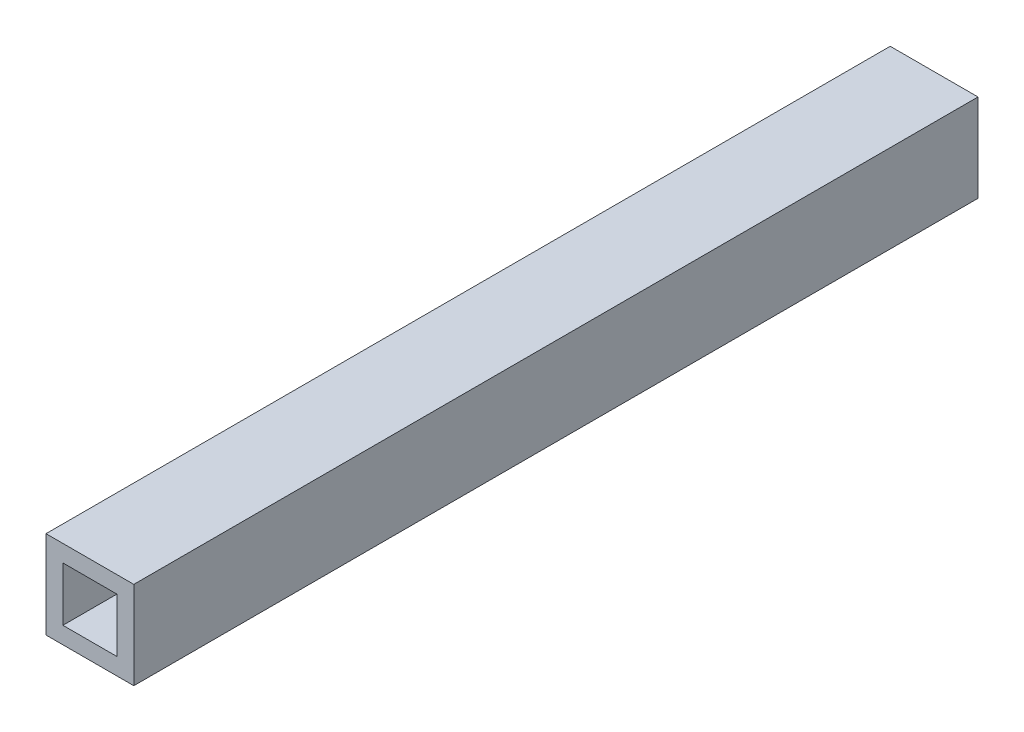
ISO-10303-21;
HEADER;
FILE_DESCRIPTION(('STEP AP214'),'2;1');
FILE_NAME('part.step','',(''),(''),'','','');
FILE_SCHEMA(('AUTOMOTIVE_DESIGN { 1 0 10303 214 1 1 1 1 }'));
ENDSEC;
DATA;
#1=APPLICATION_CONTEXT('core data for automotive mechanical design processes');
#2=APPLICATION_PROTOCOL_DEFINITION('international standard','automotive_design',2000,#1);
#3=PRODUCT_CONTEXT('',#1,'mechanical');
#4=PRODUCT('Part','Part','',(#3));
#5=PRODUCT_RELATED_PRODUCT_CATEGORY('part','',(#4));
#6=PRODUCT_DEFINITION_FORMATION('','',#4);
#7=PRODUCT_DEFINITION_CONTEXT('part definition',#1,'design');
#8=PRODUCT_DEFINITION('design','',#6,#7);
#9=PRODUCT_DEFINITION_SHAPE('','',#8);
#10=(LENGTH_UNIT() NAMED_UNIT(*) SI_UNIT(.MILLI.,.METRE.));
#11=(NAMED_UNIT(*) PLANE_ANGLE_UNIT() SI_UNIT($,.RADIAN.));
#12=(NAMED_UNIT(*) SI_UNIT($,.STERADIAN.) SOLID_ANGLE_UNIT());
#13=UNCERTAINTY_MEASURE_WITH_UNIT(LENGTH_MEASURE(1.E-05),#10,'distance_accuracy_value','');
#14=(GEOMETRIC_REPRESENTATION_CONTEXT(3) GLOBAL_UNCERTAINTY_ASSIGNED_CONTEXT((#13)) GLOBAL_UNIT_ASSIGNED_CONTEXT((#10,
#11,#12)) REPRESENTATION_CONTEXT('',''));
#15=CARTESIAN_POINT('',(0.,0.,0.));
#16=DIRECTION('',(0.,0.,1.));
#17=DIRECTION('',(1.,0.,0.));
#18=AXIS2_PLACEMENT_3D('',#15,#16,#17);
#19=CARTESIAN_POINT('',(0.,0.,10.));
#20=DIRECTION('',(0.,0.,-1.));
#21=DIRECTION('',(-1.,0.,0.));
#22=AXIS2_PLACEMENT_3D('',#19,#20,#21);
#23=PLANE('',#22);
#24=DIRECTION('',(-1.,0.,0.));
#25=VECTOR('',#24,1.);
#26=CARTESIAN_POINT('',(-19.3872922312086,-16.1708129393611,10.));
#27=LINE('',#26,#25);
#28=CARTESIAN_POINT('',(-18.3472922312086,-16.1708129393611,10.));
#29=VERTEX_POINT('',#28);
#30=CARTESIAN_POINT('',(-19.3872922312086,-16.1708129393611,10.));
#31=VERTEX_POINT('',#30);
#32=EDGE_CURVE('E153',#29,#31,#27,.T.);
#33=ORIENTED_EDGE('',*,*,#32,.T.);
#34=DIRECTION('',(0.,-1.,0.));
#35=VECTOR('',#34,1.);
#36=CARTESIAN_POINT('',(-19.3872922312086,-16.1708129393611,10.));
#37=LINE('',#36,#35);
#38=CARTESIAN_POINT('',(-19.3872922312086,-17.2108129393611,10.));
#39=VERTEX_POINT('',#38);
#40=EDGE_CURVE('E157',#31,#39,#37,.T.);
#41=ORIENTED_EDGE('',*,*,#40,.T.);
#42=DIRECTION('',(1.,0.,0.));
#43=VECTOR('',#42,1.);
#44=CARTESIAN_POINT('',(-19.3872922312086,-17.2108129393611,10.));
#45=LINE('',#44,#43);
#46=CARTESIAN_POINT('',(-18.3472922312086,-17.2108129393611,10.));
#47=VERTEX_POINT('',#46);
#48=EDGE_CURVE('E161',#39,#47,#45,.T.);
#49=ORIENTED_EDGE('',*,*,#48,.T.);
#50=DIRECTION('',(0.,1.,0.));
#51=VECTOR('',#50,1.);
#52=CARTESIAN_POINT('',(-18.3472922312086,-16.1708129393611,10.));
#53=LINE('',#52,#51);
#54=EDGE_CURVE('E164',#47,#29,#53,.T.);
#55=ORIENTED_EDGE('',*,*,#54,.T.);
#56=EDGE_LOOP('',(#33,#41,#49,#55));
#57=FACE_BOUND('',#56,.T.);
#58=DIRECTION('',(0.,1.,0.));
#59=VECTOR('',#58,1.);
#60=CARTESIAN_POINT('',(-18.5472922312086,-16.3708129393611,10.));
#61=LINE('',#60,#59);
#62=CARTESIAN_POINT('',(-18.5472922312086,-17.0108129393611,10.));
#63=VERTEX_POINT('',#62);
#64=CARTESIAN_POINT('',(-18.5472922312086,-16.3708129393611,10.));
#65=VERTEX_POINT('',#64);
#66=EDGE_CURVE('E105',#63,#65,#61,.T.);
#67=ORIENTED_EDGE('',*,*,#66,.F.);
#68=DIRECTION('',(1.,0.,0.));
#69=VECTOR('',#68,1.);
#70=CARTESIAN_POINT('',(-19.1872922312086,-17.0108129393611,10.));
#71=LINE('',#70,#69);
#72=CARTESIAN_POINT('',(-19.1872922312086,-17.0108129393611,10.));
#73=VERTEX_POINT('',#72);
#74=EDGE_CURVE('E131',#73,#63,#71,.T.);
#75=ORIENTED_EDGE('',*,*,#74,.F.);
#76=DIRECTION('',(0.,-1.,0.));
#77=VECTOR('',#76,1.);
#78=CARTESIAN_POINT('',(-19.1872922312086,-16.3708129393611,10.));
#79=LINE('',#78,#77);
#80=CARTESIAN_POINT('',(-19.1872922312086,-16.3708129393611,10.));
#81=VERTEX_POINT('',#80);
#82=EDGE_CURVE('E127',#81,#73,#79,.T.);
#83=ORIENTED_EDGE('',*,*,#82,.F.);
#84=DIRECTION('',(-1.,0.,0.));
#85=VECTOR('',#84,1.);
#86=CARTESIAN_POINT('',(-19.1872922312086,-16.3708129393611,10.));
#87=LINE('',#86,#85);
#88=EDGE_CURVE('E114',#65,#81,#87,.T.);
#89=ORIENTED_EDGE('',*,*,#88,.F.);
#90=EDGE_LOOP('',(#67,#75,#83,#89));
#91=FACE_BOUND('',#90,.T.);
#92=ADVANCED_FACE('F39',(#57,#91),#23,.F.);
#93=CARTESIAN_POINT('',(0.,0.,0.));
#94=DIRECTION('',(0.,0.,-1.));
#95=DIRECTION('',(-1.,0.,0.));
#96=AXIS2_PLACEMENT_3D('',#93,#94,#95);
#97=PLANE('',#96);
#98=DIRECTION('',(-1.,0.,0.));
#99=VECTOR('',#98,1.);
#100=CARTESIAN_POINT('',(-19.3872922312086,-16.1708129393611,0.));
#101=LINE('',#100,#99);
#102=CARTESIAN_POINT('',(-18.3472922312086,-16.1708129393611,0.));
#103=VERTEX_POINT('',#102);
#104=CARTESIAN_POINT('',(-19.3872922312086,-16.1708129393611,0.));
#105=VERTEX_POINT('',#104);
#106=EDGE_CURVE('E123',#103,#105,#101,.T.);
#107=ORIENTED_EDGE('',*,*,#106,.F.);
#108=DIRECTION('',(0.,1.,0.));
#109=VECTOR('',#108,1.);
#110=CARTESIAN_POINT('',(-18.3472922312086,-16.1708129393611,0.));
#111=LINE('',#110,#109);
#112=CARTESIAN_POINT('',(-18.3472922312086,-17.2108129393611,0.));
#113=VERTEX_POINT('',#112);
#114=EDGE_CURVE('E158',#113,#103,#111,.T.);
#115=ORIENTED_EDGE('',*,*,#114,.F.);
#116=DIRECTION('',(1.,0.,0.));
#117=VECTOR('',#116,1.);
#118=CARTESIAN_POINT('',(-19.3872922312086,-17.2108129393611,0.));
#119=LINE('',#118,#117);
#120=CARTESIAN_POINT('',(-19.3872922312086,-17.2108129393611,0.));
#121=VERTEX_POINT('',#120);
#122=EDGE_CURVE('E174',#121,#113,#119,.T.);
#123=ORIENTED_EDGE('',*,*,#122,.F.);
#124=DIRECTION('',(0.,-1.,0.));
#125=VECTOR('',#124,1.);
#126=CARTESIAN_POINT('',(-19.3872922312086,-16.1708129393611,0.));
#127=LINE('',#126,#125);
#128=EDGE_CURVE('E171',#105,#121,#127,.T.);
#129=ORIENTED_EDGE('',*,*,#128,.F.);
#130=EDGE_LOOP('',(#107,#115,#123,#129));
#131=FACE_BOUND('',#130,.T.);
#132=DIRECTION('',(1.,0.,0.));
#133=VECTOR('',#132,1.);
#134=CARTESIAN_POINT('',(-19.1872922312086,-17.0108129393611,0.));
#135=LINE('',#134,#133);
#136=CARTESIAN_POINT('',(-19.1872922312086,-17.0108129393611,0.));
#137=VERTEX_POINT('',#136);
#138=CARTESIAN_POINT('',(-18.5472922312086,-17.0108129393611,0.));
#139=VERTEX_POINT('',#138);
#140=EDGE_CURVE('E115',#137,#139,#135,.T.);
#141=ORIENTED_EDGE('',*,*,#140,.T.);
#142=DIRECTION('',(0.,1.,0.));
#143=VECTOR('',#142,1.);
#144=CARTESIAN_POINT('',(-18.5472922312086,-16.3708129393611,0.));
#145=LINE('',#144,#143);
#146=CARTESIAN_POINT('',(-18.5472922312086,-16.3708129393611,0.));
#147=VERTEX_POINT('',#146);
#148=EDGE_CURVE('E63',#139,#147,#145,.T.);
#149=ORIENTED_EDGE('',*,*,#148,.T.);
#150=DIRECTION('',(-1.,0.,0.));
#151=VECTOR('',#150,1.);
#152=CARTESIAN_POINT('',(-19.1872922312086,-16.3708129393611,0.));
#153=LINE('',#152,#151);
#154=CARTESIAN_POINT('',(-19.1872922312086,-16.3708129393611,0.));
#155=VERTEX_POINT('',#154);
#156=EDGE_CURVE('E121',#147,#155,#153,.T.);
#157=ORIENTED_EDGE('',*,*,#156,.T.);
#158=DIRECTION('',(0.,-1.,0.));
#159=VECTOR('',#158,1.);
#160=CARTESIAN_POINT('',(-19.1872922312086,-16.3708129393611,0.));
#161=LINE('',#160,#159);
#162=EDGE_CURVE('E140',#155,#137,#161,.T.);
#163=ORIENTED_EDGE('',*,*,#162,.T.);
#164=EDGE_LOOP('',(#141,#149,#157,#163));
#165=FACE_BOUND('',#164,.T.);
#166=ADVANCED_FACE('F197',(#131,#165),#97,.T.);
#167=CARTESIAN_POINT('',(-19.3872922312086,-16.1708129393611,10.));
#168=DIRECTION('',(0.,-1.,0.));
#169=DIRECTION('',(0.,0.,-1.));
#170=AXIS2_PLACEMENT_3D('',#167,#168,#169);
#171=PLANE('',#170);
#172=ORIENTED_EDGE('',*,*,#106,.T.);
#173=DIRECTION('',(0.,0.,-1.));
#174=VECTOR('',#173,1.);
#175=CARTESIAN_POINT('',(-19.3872922312086,-16.1708129393611,10.));
#176=LINE('',#175,#174);
#177=EDGE_CURVE('E11',#31,#105,#176,.T.);
#178=ORIENTED_EDGE('',*,*,#177,.F.);
#179=ORIENTED_EDGE('',*,*,#32,.F.);
#180=DIRECTION('',(0.,0.,-1.));
#181=VECTOR('',#180,1.);
#182=CARTESIAN_POINT('',(-18.3472922312086,-16.1708129393611,10.));
#183=LINE('',#182,#181);
#184=EDGE_CURVE('E167',#29,#103,#183,.T.);
#185=ORIENTED_EDGE('',*,*,#184,.T.);
#186=EDGE_LOOP('',(#172,#178,#179,#185));
#187=FACE_BOUND('',#186,.T.);
#188=ADVANCED_FACE('F41',(#187),#171,.F.);
#189=CARTESIAN_POINT('',(-19.3872922312086,-16.1708129393611,10.));
#190=DIRECTION('',(1.,0.,0.));
#191=DIRECTION('',(0.,0.,-1.));
#192=AXIS2_PLACEMENT_3D('',#189,#190,#191);
#193=PLANE('',#192);
#194=ORIENTED_EDGE('',*,*,#128,.T.);
#195=DIRECTION('',(0.,0.,-1.));
#196=VECTOR('',#195,1.);
#197=CARTESIAN_POINT('',(-19.3872922312086,-17.2108129393611,10.));
#198=LINE('',#197,#196);
#199=EDGE_CURVE('E48',#39,#121,#198,.T.);
#200=ORIENTED_EDGE('',*,*,#199,.F.);
#201=ORIENTED_EDGE('',*,*,#40,.F.);
#202=ORIENTED_EDGE('',*,*,#177,.T.);
#203=EDGE_LOOP('',(#194,#200,#201,#202));
#204=FACE_BOUND('',#203,.T.);
#205=ADVANCED_FACE('F207',(#204),#193,.F.);
#206=CARTESIAN_POINT('',(-19.3872922312086,-17.2108129393611,10.));
#207=DIRECTION('',(0.,1.,0.));
#208=DIRECTION('',(0.,0.,1.));
#209=AXIS2_PLACEMENT_3D('',#206,#207,#208);
#210=PLANE('',#209);
#211=ORIENTED_EDGE('',*,*,#122,.T.);
#212=DIRECTION('',(0.,0.,-1.));
#213=VECTOR('',#212,1.);
#214=CARTESIAN_POINT('',(-18.3472922312086,-17.2108129393611,10.));
#215=LINE('',#214,#213);
#216=EDGE_CURVE('E182',#47,#113,#215,.T.);
#217=ORIENTED_EDGE('',*,*,#216,.F.);
#218=ORIENTED_EDGE('',*,*,#48,.F.);
#219=ORIENTED_EDGE('',*,*,#199,.T.);
#220=EDGE_LOOP('',(#211,#217,#218,#219));
#221=FACE_BOUND('',#220,.T.);
#222=ADVANCED_FACE('F191',(#221),#210,.F.);
#223=CARTESIAN_POINT('',(-18.3472922312086,-16.1708129393611,10.));
#224=DIRECTION('',(-1.,0.,0.));
#225=DIRECTION('',(0.,0.,1.));
#226=AXIS2_PLACEMENT_3D('',#223,#224,#225);
#227=PLANE('',#226);
#228=ORIENTED_EDGE('',*,*,#114,.T.);
#229=ORIENTED_EDGE('',*,*,#184,.F.);
#230=ORIENTED_EDGE('',*,*,#54,.F.);
#231=ORIENTED_EDGE('',*,*,#216,.T.);
#232=EDGE_LOOP('',(#228,#229,#230,#231));
#233=FACE_BOUND('',#232,.T.);
#234=ADVANCED_FACE('F201',(#233),#227,.F.);
#235=CARTESIAN_POINT('',(-18.5472922312086,-16.3708129393611,10.));
#236=DIRECTION('',(-1.,0.,0.));
#237=DIRECTION('',(0.,0.,1.));
#238=AXIS2_PLACEMENT_3D('',#235,#236,#237);
#239=PLANE('',#238);
#240=ORIENTED_EDGE('',*,*,#148,.F.);
#241=DIRECTION('',(0.,0.,-1.));
#242=VECTOR('',#241,1.);
#243=CARTESIAN_POINT('',(-18.5472922312086,-17.0108129393611,10.));
#244=LINE('',#243,#242);
#245=EDGE_CURVE('E109',#63,#139,#244,.T.);
#246=ORIENTED_EDGE('',*,*,#245,.F.);
#247=ORIENTED_EDGE('',*,*,#66,.T.);
#248=DIRECTION('',(0.,0.,-1.));
#249=VECTOR('',#248,1.);
#250=CARTESIAN_POINT('',(-18.5472922312086,-16.3708129393611,10.));
#251=LINE('',#250,#249);
#252=EDGE_CURVE('E108',#65,#147,#251,.T.);
#253=ORIENTED_EDGE('',*,*,#252,.T.);
#254=EDGE_LOOP('',(#240,#246,#247,#253));
#255=FACE_BOUND('',#254,.T.);
#256=ADVANCED_FACE('F107',(#255),#239,.T.);
#257=CARTESIAN_POINT('',(-19.1872922312086,-16.3708129393611,10.));
#258=DIRECTION('',(0.,-1.,0.));
#259=DIRECTION('',(0.,0.,-1.));
#260=AXIS2_PLACEMENT_3D('',#257,#258,#259);
#261=PLANE('',#260);
#262=ORIENTED_EDGE('',*,*,#156,.F.);
#263=ORIENTED_EDGE('',*,*,#252,.F.);
#264=ORIENTED_EDGE('',*,*,#88,.T.);
#265=DIRECTION('',(0.,0.,-1.));
#266=VECTOR('',#265,1.);
#267=CARTESIAN_POINT('',(-19.1872922312086,-16.3708129393611,10.));
#268=LINE('',#267,#266);
#269=EDGE_CURVE('E124',#81,#155,#268,.T.);
#270=ORIENTED_EDGE('',*,*,#269,.T.);
#271=EDGE_LOOP('',(#262,#263,#264,#270));
#272=FACE_BOUND('',#271,.T.);
#273=ADVANCED_FACE('F118',(#272),#261,.T.);
#274=CARTESIAN_POINT('',(-19.1872922312086,-16.3708129393611,10.));
#275=DIRECTION('',(1.,0.,0.));
#276=DIRECTION('',(0.,1.,0.));
#277=AXIS2_PLACEMENT_3D('',#274,#275,#276);
#278=PLANE('',#277);
#279=ORIENTED_EDGE('',*,*,#162,.F.);
#280=ORIENTED_EDGE('',*,*,#269,.F.);
#281=ORIENTED_EDGE('',*,*,#82,.T.);
#282=DIRECTION('',(0.,0.,-1.));
#283=VECTOR('',#282,1.);
#284=CARTESIAN_POINT('',(-19.1872922312086,-17.0108129393611,10.));
#285=LINE('',#284,#283);
#286=EDGE_CURVE('E55',#73,#137,#285,.T.);
#287=ORIENTED_EDGE('',*,*,#286,.T.);
#288=EDGE_LOOP('',(#279,#280,#281,#287));
#289=FACE_BOUND('',#288,.T.);
#290=ADVANCED_FACE('F230',(#289),#278,.T.);
#291=CARTESIAN_POINT('',(-19.1872922312086,-17.0108129393611,10.));
#292=DIRECTION('',(0.,1.,0.));
#293=DIRECTION('',(0.,0.,1.));
#294=AXIS2_PLACEMENT_3D('',#291,#292,#293);
#295=PLANE('',#294);
#296=ORIENTED_EDGE('',*,*,#140,.F.);
#297=ORIENTED_EDGE('',*,*,#286,.F.);
#298=ORIENTED_EDGE('',*,*,#74,.T.);
#299=ORIENTED_EDGE('',*,*,#245,.T.);
#300=EDGE_LOOP('',(#296,#297,#298,#299));
#301=FACE_BOUND('',#300,.T.);
#302=ADVANCED_FACE('F234',(#301),#295,.T.);
#303=CLOSED_SHELL('',(#92,#166,#188,#205,#222,#234,#256,#273,#290,#302));
#304=MANIFOLD_SOLID_BREP('B2',#303);
#305=ADVANCED_BREP_SHAPE_REPRESENTATION('',(#18,#304),#14);
#306=SHAPE_DEFINITION_REPRESENTATION(#9,#305);
ENDSEC;
END-ISO-10303-21;
